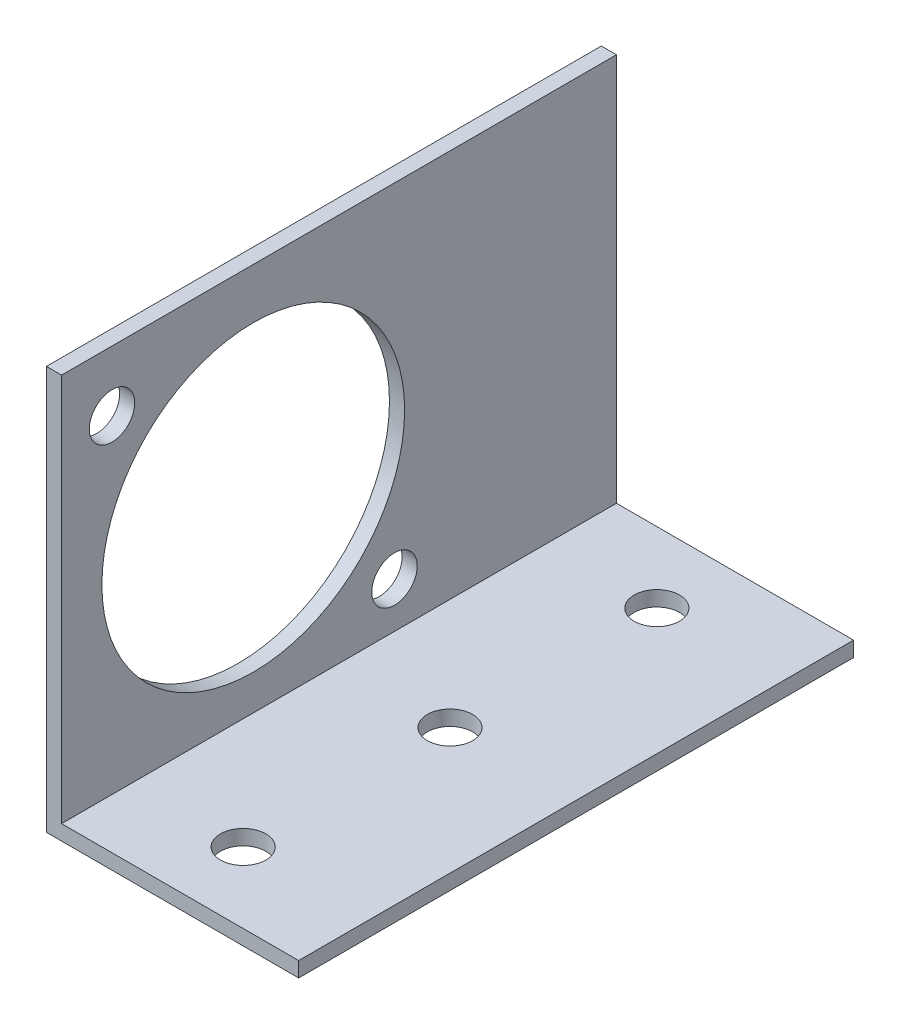
ISO-10303-21;
HEADER;
FILE_DESCRIPTION(('STEP AP214'),'2;1');
FILE_NAME('part.step','',(''),(''),'','','');
FILE_SCHEMA(('AUTOMOTIVE_DESIGN { 1 0 10303 214 1 1 1 1 }'));
ENDSEC;
DATA;
#1=APPLICATION_CONTEXT('core data for automotive mechanical design processes');
#2=APPLICATION_PROTOCOL_DEFINITION('international standard','automotive_design',2000,#1);
#3=PRODUCT_CONTEXT('',#1,'mechanical');
#4=PRODUCT('Part','Part','',(#3));
#5=PRODUCT_RELATED_PRODUCT_CATEGORY('part','',(#4));
#6=PRODUCT_DEFINITION_FORMATION('','',#4);
#7=PRODUCT_DEFINITION_CONTEXT('part definition',#1,'design');
#8=PRODUCT_DEFINITION('design','',#6,#7);
#9=PRODUCT_DEFINITION_SHAPE('','',#8);
#10=(LENGTH_UNIT() NAMED_UNIT(*) SI_UNIT(.MILLI.,.METRE.));
#11=(NAMED_UNIT(*) PLANE_ANGLE_UNIT() SI_UNIT($,.RADIAN.));
#12=(NAMED_UNIT(*) SI_UNIT($,.STERADIAN.) SOLID_ANGLE_UNIT());
#13=UNCERTAINTY_MEASURE_WITH_UNIT(LENGTH_MEASURE(1.E-05),#10,'distance_accuracy_value','');
#14=(GEOMETRIC_REPRESENTATION_CONTEXT(3) GLOBAL_UNCERTAINTY_ASSIGNED_CONTEXT((#13)) GLOBAL_UNIT_ASSIGNED_CONTEXT((#10,
#11,#12)) REPRESENTATION_CONTEXT('',''));
#15=CARTESIAN_POINT('',(0.,0.,0.));
#16=DIRECTION('',(0.,0.,1.));
#17=DIRECTION('',(1.,0.,0.));
#18=AXIS2_PLACEMENT_3D('',#15,#16,#17);
#19=CARTESIAN_POINT('',(1.5,0.,-55.));
#20=DIRECTION('',(1.,0.,0.));
#21=DIRECTION('',(0.,0.,-1.));
#22=AXIS2_PLACEMENT_3D('',#19,#20,#21);
#23=PLANE('',#22);
#24=CARTESIAN_POINT('',(1.5,20.,-19.));
#25=DIRECTION('',(1.,0.,0.));
#26=DIRECTION('',(0.,0.,-1.));
#27=AXIS2_PLACEMENT_3D('',#24,#25,#26);
#28=CIRCLE('',#27,15.);
#29=CARTESIAN_POINT('',(1.5,20.,-34.));
#30=VERTEX_POINT('',#29);
#31=EDGE_CURVE('E199',#30,#30,#28,.T.);
#32=ORIENTED_EDGE('',*,*,#31,.F.);
#33=EDGE_LOOP('',(#32));
#34=FACE_BOUND('',#33,.T.);
#35=CARTESIAN_POINT('',(1.5,34.,-5.));
#36=DIRECTION('',(1.,0.,0.));
#37=DIRECTION('',(0.,0.,-1.));
#38=AXIS2_PLACEMENT_3D('',#35,#36,#37);
#39=CIRCLE('',#38,2.25);
#40=CARTESIAN_POINT('',(1.5,34.,-7.25));
#41=VERTEX_POINT('',#40);
#42=EDGE_CURVE('E201',#41,#41,#39,.T.);
#43=ORIENTED_EDGE('',*,*,#42,.F.);
#44=EDGE_LOOP('',(#43));
#45=FACE_BOUND('',#44,.T.);
#46=CARTESIAN_POINT('',(1.5,6.,-33.));
#47=DIRECTION('',(1.,0.,0.));
#48=DIRECTION('',(0.,0.,-1.));
#49=AXIS2_PLACEMENT_3D('',#46,#47,#48);
#50=CIRCLE('',#49,2.25);
#51=CARTESIAN_POINT('',(1.5,6.,-35.25));
#52=VERTEX_POINT('',#51);
#53=EDGE_CURVE('E209',#52,#52,#50,.T.);
#54=ORIENTED_EDGE('',*,*,#53,.F.);
#55=EDGE_LOOP('',(#54));
#56=FACE_BOUND('',#55,.T.);
#57=DIRECTION('',(0.,1.,0.));
#58=VECTOR('',#57,1.);
#59=CARTESIAN_POINT('',(1.5,0.,0.));
#60=LINE('',#59,#58);
#61=CARTESIAN_POINT('',(1.5,1.5,0.));
#62=VERTEX_POINT('',#61);
#63=CARTESIAN_POINT('',(1.5,40.,0.));
#64=VERTEX_POINT('',#63);
#65=EDGE_CURVE('E113',#62,#64,#60,.T.);
#66=ORIENTED_EDGE('',*,*,#65,.F.);
#67=DIRECTION('',(0.,0.,1.));
#68=VECTOR('',#67,1.);
#69=CARTESIAN_POINT('',(1.5,1.5,-55.));
#70=LINE('',#69,#68);
#71=CARTESIAN_POINT('',(1.5,1.5,-55.));
#72=VERTEX_POINT('',#71);
#73=EDGE_CURVE('E11',#72,#62,#70,.T.);
#74=ORIENTED_EDGE('',*,*,#73,.F.);
#75=DIRECTION('',(0.,1.,0.));
#76=VECTOR('',#75,1.);
#77=CARTESIAN_POINT('',(1.5,0.,-55.));
#78=LINE('',#77,#76);
#79=CARTESIAN_POINT('',(1.5,40.,-55.));
#80=VERTEX_POINT('',#79);
#81=EDGE_CURVE('E127',#72,#80,#78,.T.);
#82=ORIENTED_EDGE('',*,*,#81,.T.);
#83=DIRECTION('',(0.,0.,1.));
#84=VECTOR('',#83,1.);
#85=CARTESIAN_POINT('',(1.5,40.,-55.));
#86=LINE('',#85,#84);
#87=EDGE_CURVE('E34',#80,#64,#86,.T.);
#88=ORIENTED_EDGE('',*,*,#87,.T.);
#89=EDGE_LOOP('',(#66,#74,#82,#88));
#90=FACE_BOUND('',#89,.T.);
#91=ADVANCED_FACE('F31',(#34,#45,#56,#90),#23,.T.);
#92=CARTESIAN_POINT('',(0.,1.5,-55.));
#93=DIRECTION('',(0.,1.,0.));
#94=DIRECTION('',(0.,0.,1.));
#95=AXIS2_PLACEMENT_3D('',#92,#93,#94);
#96=PLANE('',#95);
#97=CARTESIAN_POINT('',(12.5,1.5,-7.));
#98=DIRECTION('',(0.,1.,0.));
#99=DIRECTION('',(0.,0.,1.));
#100=AXIS2_PLACEMENT_3D('',#97,#98,#99);
#101=CIRCLE('',#100,2.25);
#102=CARTESIAN_POINT('',(12.5,1.5,-4.75));
#103=VERTEX_POINT('',#102);
#104=EDGE_CURVE('E215',#103,#103,#101,.T.);
#105=ORIENTED_EDGE('',*,*,#104,.F.);
#106=EDGE_LOOP('',(#105));
#107=FACE_BOUND('',#106,.T.);
#108=CARTESIAN_POINT('',(12.5,1.5,-27.5));
#109=DIRECTION('',(0.,1.,0.));
#110=DIRECTION('',(0.,0.,1.));
#111=AXIS2_PLACEMENT_3D('',#108,#109,#110);
#112=CIRCLE('',#111,2.25);
#113=CARTESIAN_POINT('',(12.5,1.5,-25.25));
#114=VERTEX_POINT('',#113);
#115=EDGE_CURVE('E221',#114,#114,#112,.T.);
#116=ORIENTED_EDGE('',*,*,#115,.F.);
#117=EDGE_LOOP('',(#116));
#118=FACE_BOUND('',#117,.T.);
#119=CARTESIAN_POINT('',(12.5,1.5,-48.));
#120=DIRECTION('',(0.,1.,0.));
#121=DIRECTION('',(0.,0.,1.));
#122=AXIS2_PLACEMENT_3D('',#119,#120,#121);
#123=CIRCLE('',#122,2.25);
#124=CARTESIAN_POINT('',(12.5,1.5,-45.75));
#125=VERTEX_POINT('',#124);
#126=EDGE_CURVE('E227',#125,#125,#123,.T.);
#127=ORIENTED_EDGE('',*,*,#126,.F.);
#128=EDGE_LOOP('',(#127));
#129=FACE_BOUND('',#128,.T.);
#130=DIRECTION('',(1.,0.,0.));
#131=VECTOR('',#130,1.);
#132=CARTESIAN_POINT('',(0.,1.5,0.));
#133=LINE('',#132,#131);
#134=CARTESIAN_POINT('',(25.,1.5,0.));
#135=VERTEX_POINT('',#134);
#136=EDGE_CURVE('E125',#135,#62,#133,.F.);
#137=ORIENTED_EDGE('',*,*,#136,.F.);
#138=DIRECTION('',(0.,0.,1.));
#139=VECTOR('',#138,1.);
#140=CARTESIAN_POINT('',(25.,1.5,-55.));
#141=LINE('',#140,#139);
#142=CARTESIAN_POINT('',(25.,1.5,-55.));
#143=VERTEX_POINT('',#142);
#144=EDGE_CURVE('E40',#143,#135,#141,.T.);
#145=ORIENTED_EDGE('',*,*,#144,.F.);
#146=DIRECTION('',(1.,0.,0.));
#147=VECTOR('',#146,1.);
#148=CARTESIAN_POINT('',(0.,1.5,-55.));
#149=LINE('',#148,#147);
#150=EDGE_CURVE('E94',#143,#72,#149,.F.);
#151=ORIENTED_EDGE('',*,*,#150,.T.);
#152=ORIENTED_EDGE('',*,*,#73,.T.);
#153=EDGE_LOOP('',(#137,#145,#151,#152));
#154=FACE_BOUND('',#153,.T.);
#155=ADVANCED_FACE('F139',(#107,#118,#129,#154),#96,.T.);
#156=CARTESIAN_POINT('',(25.,1.5,-55.));
#157=DIRECTION('',(-1.,0.,0.));
#158=DIRECTION('',(0.,0.,1.));
#159=AXIS2_PLACEMENT_3D('',#156,#157,#158);
#160=PLANE('',#159);
#161=DIRECTION('',(0.,-1.,0.));
#162=VECTOR('',#161,1.);
#163=CARTESIAN_POINT('',(25.,1.5,0.));
#164=LINE('',#163,#162);
#165=CARTESIAN_POINT('',(25.,0.,0.));
#166=VERTEX_POINT('',#165);
#167=EDGE_CURVE('E99',#135,#166,#164,.T.);
#168=ORIENTED_EDGE('',*,*,#167,.T.);
#169=DIRECTION('',(0.,0.,1.));
#170=VECTOR('',#169,1.);
#171=CARTESIAN_POINT('',(25.,0.,-55.));
#172=LINE('',#171,#170);
#173=CARTESIAN_POINT('',(25.,0.,-55.));
#174=VERTEX_POINT('',#173);
#175=EDGE_CURVE('E97',#174,#166,#172,.T.);
#176=ORIENTED_EDGE('',*,*,#175,.F.);
#177=DIRECTION('',(0.,-1.,0.));
#178=VECTOR('',#177,1.);
#179=CARTESIAN_POINT('',(25.,1.5,-55.));
#180=LINE('',#179,#178);
#181=EDGE_CURVE('E88',#143,#174,#180,.T.);
#182=ORIENTED_EDGE('',*,*,#181,.F.);
#183=ORIENTED_EDGE('',*,*,#144,.T.);
#184=EDGE_LOOP('',(#168,#176,#182,#183));
#185=FACE_BOUND('',#184,.T.);
#186=ADVANCED_FACE('F98',(#185),#160,.F.);
#187=CARTESIAN_POINT('',(0.,0.,-55.));
#188=DIRECTION('',(0.,1.,0.));
#189=DIRECTION('',(0.,0.,1.));
#190=AXIS2_PLACEMENT_3D('',#187,#188,#189);
#191=PLANE('',#190);
#192=CARTESIAN_POINT('',(12.5,0.,-7.));
#193=DIRECTION('',(0.,1.,0.));
#194=DIRECTION('',(0.,0.,1.));
#195=AXIS2_PLACEMENT_3D('',#192,#193,#194);
#196=CIRCLE('',#195,2.25);
#197=CARTESIAN_POINT('',(12.5,0.,-4.75));
#198=VERTEX_POINT('',#197);
#199=EDGE_CURVE('E218',#198,#198,#196,.T.);
#200=ORIENTED_EDGE('',*,*,#199,.T.);
#201=EDGE_LOOP('',(#200));
#202=FACE_BOUND('',#201,.T.);
#203=CARTESIAN_POINT('',(12.5,0.,-27.5));
#204=DIRECTION('',(0.,1.,0.));
#205=DIRECTION('',(0.,0.,1.));
#206=AXIS2_PLACEMENT_3D('',#203,#204,#205);
#207=CIRCLE('',#206,2.25);
#208=CARTESIAN_POINT('',(12.5,0.,-25.25));
#209=VERTEX_POINT('',#208);
#210=EDGE_CURVE('E224',#209,#209,#207,.T.);
#211=ORIENTED_EDGE('',*,*,#210,.T.);
#212=EDGE_LOOP('',(#211));
#213=FACE_BOUND('',#212,.T.);
#214=CARTESIAN_POINT('',(12.5,0.,-48.));
#215=DIRECTION('',(0.,1.,0.));
#216=DIRECTION('',(0.,0.,1.));
#217=AXIS2_PLACEMENT_3D('',#214,#215,#216);
#218=CIRCLE('',#217,2.25);
#219=CARTESIAN_POINT('',(12.5,0.,-45.75));
#220=VERTEX_POINT('',#219);
#221=EDGE_CURVE('E117',#220,#220,#218,.T.);
#222=ORIENTED_EDGE('',*,*,#221,.T.);
#223=EDGE_LOOP('',(#222));
#224=FACE_BOUND('',#223,.T.);
#225=DIRECTION('',(-1.,0.,0.));
#226=VECTOR('',#225,1.);
#227=CARTESIAN_POINT('',(0.,0.,0.));
#228=LINE('',#227,#226);
#229=CARTESIAN_POINT('',(0.,0.,0.));
#230=VERTEX_POINT('',#229);
#231=EDGE_CURVE('E122',#166,#230,#228,.T.);
#232=ORIENTED_EDGE('',*,*,#231,.T.);
#233=DIRECTION('',(0.,0.,1.));
#234=VECTOR('',#233,1.);
#235=CARTESIAN_POINT('',(0.,0.,-55.));
#236=LINE('',#235,#234);
#237=CARTESIAN_POINT('',(0.,0.,-55.));
#238=VERTEX_POINT('',#237);
#239=EDGE_CURVE('E102',#238,#230,#236,.T.);
#240=ORIENTED_EDGE('',*,*,#239,.F.);
#241=DIRECTION('',(-1.,0.,0.));
#242=VECTOR('',#241,1.);
#243=CARTESIAN_POINT('',(0.,0.,-55.));
#244=LINE('',#243,#242);
#245=EDGE_CURVE('E92',#174,#238,#244,.T.);
#246=ORIENTED_EDGE('',*,*,#245,.F.);
#247=ORIENTED_EDGE('',*,*,#175,.T.);
#248=EDGE_LOOP('',(#232,#240,#246,#247));
#249=FACE_BOUND('',#248,.T.);
#250=ADVANCED_FACE('F104',(#202,#213,#224,#249),#191,.F.);
#251=CARTESIAN_POINT('',(0.,0.,-55.));
#252=DIRECTION('',(1.,0.,0.));
#253=DIRECTION('',(0.,0.,-1.));
#254=AXIS2_PLACEMENT_3D('',#251,#252,#253);
#255=PLANE('',#254);
#256=CARTESIAN_POINT('',(0.,20.,-19.));
#257=DIRECTION('',(1.,0.,0.));
#258=DIRECTION('',(0.,0.,-1.));
#259=AXIS2_PLACEMENT_3D('',#256,#257,#258);
#260=CIRCLE('',#259,15.);
#261=CARTESIAN_POINT('',(0.,20.,-34.));
#262=VERTEX_POINT('',#261);
#263=EDGE_CURVE('E196',#262,#262,#260,.T.);
#264=ORIENTED_EDGE('',*,*,#263,.T.);
#265=EDGE_LOOP('',(#264));
#266=FACE_BOUND('',#265,.T.);
#267=CARTESIAN_POINT('',(0.,34.,-5.));
#268=DIRECTION('',(1.,0.,0.));
#269=DIRECTION('',(0.,0.,-1.));
#270=AXIS2_PLACEMENT_3D('',#267,#268,#269);
#271=CIRCLE('',#270,2.25);
#272=CARTESIAN_POINT('',(0.,34.,-7.25));
#273=VERTEX_POINT('',#272);
#274=EDGE_CURVE('E206',#273,#273,#271,.T.);
#275=ORIENTED_EDGE('',*,*,#274,.T.);
#276=EDGE_LOOP('',(#275));
#277=FACE_BOUND('',#276,.T.);
#278=CARTESIAN_POINT('',(0.,6.,-33.));
#279=DIRECTION('',(1.,0.,0.));
#280=DIRECTION('',(0.,0.,-1.));
#281=AXIS2_PLACEMENT_3D('',#278,#279,#280);
#282=CIRCLE('',#281,2.25);
#283=CARTESIAN_POINT('',(0.,6.,-35.25));
#284=VERTEX_POINT('',#283);
#285=EDGE_CURVE('E212',#284,#284,#282,.T.);
#286=ORIENTED_EDGE('',*,*,#285,.T.);
#287=EDGE_LOOP('',(#286));
#288=FACE_BOUND('',#287,.T.);
#289=DIRECTION('',(0.,1.,0.));
#290=VECTOR('',#289,1.);
#291=CARTESIAN_POINT('',(0.,0.,0.));
#292=LINE('',#291,#290);
#293=CARTESIAN_POINT('',(0.,40.,0.));
#294=VERTEX_POINT('',#293);
#295=EDGE_CURVE('E120',#230,#294,#292,.T.);
#296=ORIENTED_EDGE('',*,*,#295,.T.);
#297=DIRECTION('',(0.,0.,1.));
#298=VECTOR('',#297,1.);
#299=CARTESIAN_POINT('',(0.,40.,-55.));
#300=LINE('',#299,#298);
#301=CARTESIAN_POINT('',(0.,40.,-55.));
#302=VERTEX_POINT('',#301);
#303=EDGE_CURVE('E130',#302,#294,#300,.T.);
#304=ORIENTED_EDGE('',*,*,#303,.F.);
#305=DIRECTION('',(0.,1.,0.));
#306=VECTOR('',#305,1.);
#307=CARTESIAN_POINT('',(0.,0.,-55.));
#308=LINE('',#307,#306);
#309=EDGE_CURVE('E107',#238,#302,#308,.T.);
#310=ORIENTED_EDGE('',*,*,#309,.F.);
#311=ORIENTED_EDGE('',*,*,#239,.T.);
#312=EDGE_LOOP('',(#296,#304,#310,#311));
#313=FACE_BOUND('',#312,.T.);
#314=ADVANCED_FACE('F156',(#266,#277,#288,#313),#255,.F.);
#315=CARTESIAN_POINT('',(0.,40.,-55.));
#316=DIRECTION('',(0.,-1.,0.));
#317=DIRECTION('',(0.,0.,-1.));
#318=AXIS2_PLACEMENT_3D('',#315,#316,#317);
#319=PLANE('',#318);
#320=DIRECTION('',(1.,0.,0.));
#321=VECTOR('',#320,1.);
#322=CARTESIAN_POINT('',(0.,40.,0.));
#323=LINE('',#322,#321);
#324=EDGE_CURVE('E116',#294,#64,#323,.T.);
#325=ORIENTED_EDGE('',*,*,#324,.T.);
#326=ORIENTED_EDGE('',*,*,#87,.F.);
#327=DIRECTION('',(1.,0.,0.));
#328=VECTOR('',#327,1.);
#329=CARTESIAN_POINT('',(0.,40.,-55.));
#330=LINE('',#329,#328);
#331=EDGE_CURVE('E80',#302,#80,#330,.T.);
#332=ORIENTED_EDGE('',*,*,#331,.F.);
#333=ORIENTED_EDGE('',*,*,#303,.T.);
#334=EDGE_LOOP('',(#325,#326,#332,#333));
#335=FACE_BOUND('',#334,.T.);
#336=ADVANCED_FACE('F135',(#335),#319,.F.);
#337=CARTESIAN_POINT('',(1.5,40.,-55.));
#338=DIRECTION('',(0.,0.,-1.));
#339=DIRECTION('',(-1.,0.,0.));
#340=AXIS2_PLACEMENT_3D('',#337,#338,#339);
#341=PLANE('',#340);
#342=ORIENTED_EDGE('',*,*,#81,.F.);
#343=ORIENTED_EDGE('',*,*,#150,.F.);
#344=ORIENTED_EDGE('',*,*,#181,.T.);
#345=ORIENTED_EDGE('',*,*,#245,.T.);
#346=ORIENTED_EDGE('',*,*,#309,.T.);
#347=ORIENTED_EDGE('',*,*,#331,.T.);
#348=EDGE_LOOP('',(#342,#343,#344,#345,#346,#347));
#349=FACE_BOUND('',#348,.T.);
#350=ADVANCED_FACE('F90',(#349),#341,.T.);
#351=CARTESIAN_POINT('',(1.5,40.,0.));
#352=DIRECTION('',(0.,0.,-1.));
#353=DIRECTION('',(-1.,0.,0.));
#354=AXIS2_PLACEMENT_3D('',#351,#352,#353);
#355=PLANE('',#354);
#356=ORIENTED_EDGE('',*,*,#65,.T.);
#357=ORIENTED_EDGE('',*,*,#324,.F.);
#358=ORIENTED_EDGE('',*,*,#295,.F.);
#359=ORIENTED_EDGE('',*,*,#231,.F.);
#360=ORIENTED_EDGE('',*,*,#167,.F.);
#361=ORIENTED_EDGE('',*,*,#136,.T.);
#362=EDGE_LOOP('',(#356,#357,#358,#359,#360,#361));
#363=FACE_BOUND('',#362,.T.);
#364=ADVANCED_FACE('F138',(#363),#355,.F.);
#365=CARTESIAN_POINT('',(12.5,1.5,-48.));
#366=DIRECTION('',(0.,1.,0.));
#367=DIRECTION('',(0.,0.,1.));
#368=AXIS2_PLACEMENT_3D('',#365,#366,#367);
#369=CYLINDRICAL_SURFACE('',#368,2.25);
#370=ORIENTED_EDGE('',*,*,#221,.F.);
#371=EDGE_LOOP('',(#370));
#372=FACE_BOUND('',#371,.T.);
#373=ORIENTED_EDGE('',*,*,#126,.T.);
#374=EDGE_LOOP('',(#373));
#375=FACE_BOUND('',#374,.T.);
#376=ADVANCED_FACE('F167',(#372,#375),#369,.F.);
#377=CARTESIAN_POINT('',(12.5,1.5,-27.5));
#378=DIRECTION('',(0.,1.,0.));
#379=DIRECTION('',(0.,0.,1.));
#380=AXIS2_PLACEMENT_3D('',#377,#378,#379);
#381=CYLINDRICAL_SURFACE('',#380,2.25);
#382=ORIENTED_EDGE('',*,*,#210,.F.);
#383=EDGE_LOOP('',(#382));
#384=FACE_BOUND('',#383,.T.);
#385=ORIENTED_EDGE('',*,*,#115,.T.);
#386=EDGE_LOOP('',(#385));
#387=FACE_BOUND('',#386,.T.);
#388=ADVANCED_FACE('F171',(#384,#387),#381,.F.);
#389=CARTESIAN_POINT('',(12.5,1.5,-7.));
#390=DIRECTION('',(0.,1.,0.));
#391=DIRECTION('',(0.,0.,1.));
#392=AXIS2_PLACEMENT_3D('',#389,#390,#391);
#393=CYLINDRICAL_SURFACE('',#392,2.25);
#394=ORIENTED_EDGE('',*,*,#199,.F.);
#395=EDGE_LOOP('',(#394));
#396=FACE_BOUND('',#395,.T.);
#397=ORIENTED_EDGE('',*,*,#104,.T.);
#398=EDGE_LOOP('',(#397));
#399=FACE_BOUND('',#398,.T.);
#400=ADVANCED_FACE('F175',(#396,#399),#393,.F.);
#401=CARTESIAN_POINT('',(1.5,6.,-33.));
#402=DIRECTION('',(1.,0.,0.));
#403=DIRECTION('',(0.,0.,-1.));
#404=AXIS2_PLACEMENT_3D('',#401,#402,#403);
#405=CYLINDRICAL_SURFACE('',#404,2.25);
#406=ORIENTED_EDGE('',*,*,#285,.F.);
#407=EDGE_LOOP('',(#406));
#408=FACE_BOUND('',#407,.T.);
#409=ORIENTED_EDGE('',*,*,#53,.T.);
#410=EDGE_LOOP('',(#409));
#411=FACE_BOUND('',#410,.T.);
#412=ADVANCED_FACE('F179',(#408,#411),#405,.F.);
#413=CARTESIAN_POINT('',(1.5,34.,-5.));
#414=DIRECTION('',(1.,0.,0.));
#415=DIRECTION('',(0.,0.,-1.));
#416=AXIS2_PLACEMENT_3D('',#413,#414,#415);
#417=CYLINDRICAL_SURFACE('',#416,2.25);
#418=ORIENTED_EDGE('',*,*,#274,.F.);
#419=EDGE_LOOP('',(#418));
#420=FACE_BOUND('',#419,.T.);
#421=ORIENTED_EDGE('',*,*,#42,.T.);
#422=EDGE_LOOP('',(#421));
#423=FACE_BOUND('',#422,.T.);
#424=ADVANCED_FACE('F183',(#420,#423),#417,.F.);
#425=CARTESIAN_POINT('',(1.5,20.,-19.));
#426=DIRECTION('',(1.,0.,0.));
#427=DIRECTION('',(0.,0.,-1.));
#428=AXIS2_PLACEMENT_3D('',#425,#426,#427);
#429=CYLINDRICAL_SURFACE('',#428,15.);
#430=ORIENTED_EDGE('',*,*,#263,.F.);
#431=EDGE_LOOP('',(#430));
#432=FACE_BOUND('',#431,.T.);
#433=ORIENTED_EDGE('',*,*,#31,.T.);
#434=EDGE_LOOP('',(#433));
#435=FACE_BOUND('',#434,.T.);
#436=ADVANCED_FACE('F187',(#432,#435),#429,.F.);
#437=CLOSED_SHELL('',(#91,#155,#186,#250,#314,#336,#350,#364,#376,#388,#400,#412,#424,#436));
#438=MANIFOLD_SOLID_BREP('B2',#437);
#439=ADVANCED_BREP_SHAPE_REPRESENTATION('',(#18,#438),#14);
#440=SHAPE_DEFINITION_REPRESENTATION(#9,#439);
ENDSEC;
END-ISO-10303-21;
